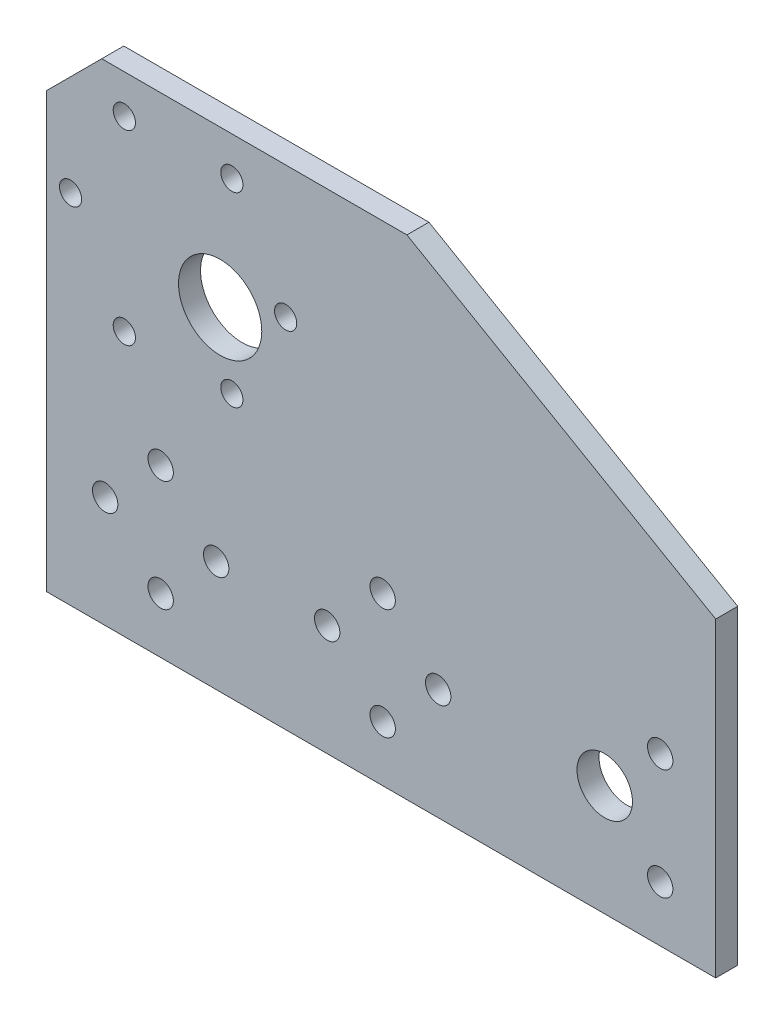
ISO-10303-21;
HEADER;
FILE_DESCRIPTION(('STEP AP214'),'2;1');
FILE_NAME('part.step','',(''),(''),'','','');
FILE_SCHEMA(('AUTOMOTIVE_DESIGN { 1 0 10303 214 1 1 1 1 }'));
ENDSEC;
DATA;
#1=APPLICATION_CONTEXT('core data for automotive mechanical design processes');
#2=APPLICATION_PROTOCOL_DEFINITION('international standard','automotive_design',2000,#1);
#3=PRODUCT_CONTEXT('',#1,'mechanical');
#4=PRODUCT('Part','Part','',(#3));
#5=PRODUCT_RELATED_PRODUCT_CATEGORY('part','',(#4));
#6=PRODUCT_DEFINITION_FORMATION('','',#4);
#7=PRODUCT_DEFINITION_CONTEXT('part definition',#1,'design');
#8=PRODUCT_DEFINITION('design','',#6,#7);
#9=PRODUCT_DEFINITION_SHAPE('','',#8);
#10=(LENGTH_UNIT() NAMED_UNIT(*) SI_UNIT(.MILLI.,.METRE.));
#11=(NAMED_UNIT(*) PLANE_ANGLE_UNIT() SI_UNIT($,.RADIAN.));
#12=(NAMED_UNIT(*) SI_UNIT($,.STERADIAN.) SOLID_ANGLE_UNIT());
#13=UNCERTAINTY_MEASURE_WITH_UNIT(LENGTH_MEASURE(1.E-05),#10,'distance_accuracy_value','');
#14=(GEOMETRIC_REPRESENTATION_CONTEXT(3) GLOBAL_UNCERTAINTY_ASSIGNED_CONTEXT((#13)) GLOBAL_UNIT_ASSIGNED_CONTEXT((#10,
#11,#12)) REPRESENTATION_CONTEXT('',''));
#15=CARTESIAN_POINT('',(0.,0.,0.));
#16=DIRECTION('',(0.,0.,1.));
#17=DIRECTION('',(1.,0.,0.));
#18=AXIS2_PLACEMENT_3D('',#15,#16,#17);
#19=CARTESIAN_POINT('',(16.,28.803791580562,-3.175));
#20=DIRECTION('',(1.,0.,0.));
#21=DIRECTION('',(0.,1.,0.));
#22=AXIS2_PLACEMENT_3D('',#19,#20,#21);
#23=PLANE('',#22);
#24=DIRECTION('',(0.,1.,0.));
#25=VECTOR('',#24,1.);
#26=CARTESIAN_POINT('',(16.,28.803791580562,0.));
#27=LINE('',#26,#25);
#28=CARTESIAN_POINT('',(16.,-16.,0.));
#29=VERTEX_POINT('',#28);
#30=CARTESIAN_POINT('',(16.,28.803791580562,0.));
#31=VERTEX_POINT('',#30);
#32=EDGE_CURVE('E117',#29,#31,#27,.T.);
#33=ORIENTED_EDGE('',*,*,#32,.F.);
#34=DIRECTION('',(0.,0.,1.));
#35=VECTOR('',#34,1.);
#36=CARTESIAN_POINT('',(16.,-16.,-3.175));
#37=LINE('',#36,#35);
#38=CARTESIAN_POINT('',(16.,-16.,-3.175));
#39=VERTEX_POINT('',#38);
#40=EDGE_CURVE('E11',#39,#29,#37,.T.);
#41=ORIENTED_EDGE('',*,*,#40,.F.);
#42=DIRECTION('',(0.,1.,0.));
#43=VECTOR('',#42,1.);
#44=CARTESIAN_POINT('',(16.,28.803791580562,-3.175));
#45=LINE('',#44,#43);
#46=CARTESIAN_POINT('',(16.,28.803791580562,-3.175));
#47=VERTEX_POINT('',#46);
#48=EDGE_CURVE('E132',#39,#47,#45,.T.);
#49=ORIENTED_EDGE('',*,*,#48,.T.);
#50=DIRECTION('',(0.,0.,1.));
#51=VECTOR('',#50,1.);
#52=CARTESIAN_POINT('',(16.,28.803791580562,-3.175));
#53=LINE('',#52,#51);
#54=EDGE_CURVE('E35',#47,#31,#53,.T.);
#55=ORIENTED_EDGE('',*,*,#54,.T.);
#56=EDGE_LOOP('',(#33,#41,#49,#55));
#57=FACE_BOUND('',#56,.T.);
#58=ADVANCED_FACE('F32',(#57),#23,.T.);
#59=CARTESIAN_POINT('',(16.,-16.,-3.175));
#60=DIRECTION('',(0.,-1.,0.));
#61=DIRECTION('',(1.,0.,0.));
#62=AXIS2_PLACEMENT_3D('',#59,#60,#61);
#63=PLANE('',#62);
#64=DIRECTION('',(1.,0.,0.));
#65=VECTOR('',#64,1.);
#66=CARTESIAN_POINT('',(16.,-16.,0.));
#67=LINE('',#66,#65);
#68=CARTESIAN_POINT('',(-80.4878036686956,-16.,0.));
#69=VERTEX_POINT('',#68);
#70=EDGE_CURVE('E130',#69,#29,#67,.T.);
#71=ORIENTED_EDGE('',*,*,#70,.F.);
#72=DIRECTION('',(0.,0.,1.));
#73=VECTOR('',#72,1.);
#74=CARTESIAN_POINT('',(-80.4878036686956,-16.,-3.175));
#75=LINE('',#74,#73);
#76=CARTESIAN_POINT('',(-80.4878036686956,-16.,-3.175));
#77=VERTEX_POINT('',#76);
#78=EDGE_CURVE('E41',#77,#69,#75,.T.);
#79=ORIENTED_EDGE('',*,*,#78,.F.);
#80=DIRECTION('',(1.,0.,0.));
#81=VECTOR('',#80,1.);
#82=CARTESIAN_POINT('',(16.,-16.,-3.175));
#83=LINE('',#82,#81);
#84=EDGE_CURVE('E107',#77,#39,#83,.T.);
#85=ORIENTED_EDGE('',*,*,#84,.T.);
#86=ORIENTED_EDGE('',*,*,#40,.T.);
#87=EDGE_LOOP('',(#71,#79,#85,#86));
#88=FACE_BOUND('',#87,.T.);
#89=ADVANCED_FACE('F140',(#88),#63,.T.);
#90=CARTESIAN_POINT('',(-80.4878036686956,-16.,-3.175));
#91=DIRECTION('',(-1.,0.,0.));
#92=DIRECTION('',(0.,0.,1.));
#93=AXIS2_PLACEMENT_3D('',#90,#91,#92);
#94=PLANE('',#93);
#95=DIRECTION('',(0.,-1.,0.));
#96=VECTOR('',#95,1.);
#97=CARTESIAN_POINT('',(-80.4878036686956,-16.,0.));
#98=LINE('',#97,#96);
#99=CARTESIAN_POINT('',(-80.4878036686956,46.5,0.));
#100=VERTEX_POINT('',#99);
#101=EDGE_CURVE('E94',#100,#69,#98,.T.);
#102=ORIENTED_EDGE('',*,*,#101,.F.);
#103=DIRECTION('',(0.,0.,1.));
#104=VECTOR('',#103,1.);
#105=CARTESIAN_POINT('',(-80.4878036686956,46.5,-3.175));
#106=LINE('',#105,#104);
#107=CARTESIAN_POINT('',(-80.4878036686956,46.5,-3.175));
#108=VERTEX_POINT('',#107);
#109=EDGE_CURVE('E89',#108,#100,#106,.T.);
#110=ORIENTED_EDGE('',*,*,#109,.F.);
#111=DIRECTION('',(0.,-1.,0.));
#112=VECTOR('',#111,1.);
#113=CARTESIAN_POINT('',(-80.4878036686956,-16.,-3.175));
#114=LINE('',#113,#112);
#115=EDGE_CURVE('E92',#108,#77,#114,.T.);
#116=ORIENTED_EDGE('',*,*,#115,.T.);
#117=ORIENTED_EDGE('',*,*,#78,.T.);
#118=EDGE_LOOP('',(#102,#110,#116,#117));
#119=FACE_BOUND('',#118,.T.);
#120=ADVANCED_FACE('F91',(#119),#94,.T.);
#121=CARTESIAN_POINT('',(-72.4878036686956,54.5000000000001,-3.175));
#122=DIRECTION('',(-0.707106781186548,0.707106781186548,0.));
#123=DIRECTION('',(-0.707106781186548,-0.707106781186548,0.));
#124=AXIS2_PLACEMENT_3D('',#121,#122,#123);
#125=PLANE('',#124);
#126=DIRECTION('',(-0.707106781186548,-0.707106781186548,0.));
#127=VECTOR('',#126,1.);
#128=CARTESIAN_POINT('',(-72.4878036686956,54.5000000000001,0.));
#129=LINE('',#128,#127);
#130=CARTESIAN_POINT('',(-72.4878036686956,54.5000000000001,0.));
#131=VERTEX_POINT('',#130);
#132=EDGE_CURVE('E127',#131,#100,#129,.T.);
#133=ORIENTED_EDGE('',*,*,#132,.F.);
#134=DIRECTION('',(0.,0.,1.));
#135=VECTOR('',#134,1.);
#136=CARTESIAN_POINT('',(-72.4878036686956,54.5000000000001,-3.175));
#137=LINE('',#136,#135);
#138=CARTESIAN_POINT('',(-72.4878036686956,54.5000000000001,-3.175));
#139=VERTEX_POINT('',#138);
#140=EDGE_CURVE('E99',#139,#131,#137,.T.);
#141=ORIENTED_EDGE('',*,*,#140,.F.);
#142=DIRECTION('',(-0.707106781186548,-0.707106781186548,0.));
#143=VECTOR('',#142,1.);
#144=CARTESIAN_POINT('',(-72.4878036686956,54.5000000000001,-3.175));
#145=LINE('',#144,#143);
#146=EDGE_CURVE('E105',#139,#108,#145,.T.);
#147=ORIENTED_EDGE('',*,*,#146,.T.);
#148=ORIENTED_EDGE('',*,*,#109,.T.);
#149=EDGE_LOOP('',(#133,#141,#147,#148));
#150=FACE_BOUND('',#149,.T.);
#151=ADVANCED_FACE('F109',(#150),#125,.T.);
#152=CARTESIAN_POINT('',(-28.5071385443465,54.5000000000002,-3.175));
#153=DIRECTION('',(0.,1.,0.));
#154=DIRECTION('',(-1.,0.,0.));
#155=AXIS2_PLACEMENT_3D('',#152,#153,#154);
#156=PLANE('',#155);
#157=DIRECTION('',(-1.,0.,0.));
#158=VECTOR('',#157,1.);
#159=CARTESIAN_POINT('',(-28.5071385443465,54.5000000000002,0.));
#160=LINE('',#159,#158);
#161=CARTESIAN_POINT('',(-28.5071385443465,54.5000000000002,0.));
#162=VERTEX_POINT('',#161);
#163=EDGE_CURVE('E124',#162,#131,#160,.T.);
#164=ORIENTED_EDGE('',*,*,#163,.F.);
#165=DIRECTION('',(0.,0.,1.));
#166=VECTOR('',#165,1.);
#167=CARTESIAN_POINT('',(-28.5071385443465,54.5000000000002,-3.175));
#168=LINE('',#167,#166);
#169=CARTESIAN_POINT('',(-28.5071385443465,54.5000000000002,-3.175));
#170=VERTEX_POINT('',#169);
#171=EDGE_CURVE('E135',#170,#162,#168,.T.);
#172=ORIENTED_EDGE('',*,*,#171,.F.);
#173=DIRECTION('',(-1.,0.,0.));
#174=VECTOR('',#173,1.);
#175=CARTESIAN_POINT('',(-28.5071385443465,54.5000000000002,-3.175));
#176=LINE('',#175,#174);
#177=EDGE_CURVE('E110',#170,#139,#176,.T.);
#178=ORIENTED_EDGE('',*,*,#177,.T.);
#179=ORIENTED_EDGE('',*,*,#140,.T.);
#180=EDGE_LOOP('',(#164,#172,#178,#179));
#181=FACE_BOUND('',#180,.T.);
#182=ADVANCED_FACE('F153',(#181),#156,.T.);
#183=CARTESIAN_POINT('',(16.,28.803791580562,-3.175));
#184=DIRECTION('',(0.499999999999999,0.866025403784441,0.));
#185=DIRECTION('',(-0.866025403784441,0.499999999999998,0.));
#186=AXIS2_PLACEMENT_3D('',#183,#184,#185);
#187=PLANE('',#186);
#188=DIRECTION('',(-0.86602540378444,0.499999999999998,0.));
#189=VECTOR('',#188,1.);
#190=CARTESIAN_POINT('',(16.,28.803791580562,0.));
#191=LINE('',#190,#189);
#192=EDGE_CURVE('E120',#31,#162,#191,.T.);
#193=ORIENTED_EDGE('',*,*,#192,.F.);
#194=ORIENTED_EDGE('',*,*,#54,.F.);
#195=DIRECTION('',(-0.86602540378444,0.499999999999998,0.));
#196=VECTOR('',#195,1.);
#197=CARTESIAN_POINT('',(16.,28.803791580562,-3.175));
#198=LINE('',#197,#196);
#199=EDGE_CURVE('E112',#47,#170,#198,.T.);
#200=ORIENTED_EDGE('',*,*,#199,.T.);
#201=ORIENTED_EDGE('',*,*,#171,.T.);
#202=EDGE_LOOP('',(#193,#194,#200,#201));
#203=FACE_BOUND('',#202,.T.);
#204=ADVANCED_FACE('F137',(#203),#187,.T.);
#205=CARTESIAN_POINT('',(0.,0.,-3.175));
#206=DIRECTION('',(0.,0.,-1.));
#207=DIRECTION('',(-1.,0.,0.));
#208=AXIS2_PLACEMENT_3D('',#205,#206,#207);
#209=PLANE('',#208);
#210=CARTESIAN_POINT('',(-32.,7.99999999999999,-3.175));
#211=DIRECTION('',(0.,0.,1.));
#212=DIRECTION('',(1.,0.,0.));
#213=AXIS2_PLACEMENT_3D('',#210,#211,#212);
#214=CIRCLE('',#213,1.82879999999999);
#215=CARTESIAN_POINT('',(-30.1712,7.99999999999999,-3.175));
#216=VERTEX_POINT('',#215);
#217=EDGE_CURVE('E243',#216,#216,#214,.T.);
#218=ORIENTED_EDGE('',*,*,#217,.T.);
#219=EDGE_LOOP('',(#218));
#220=FACE_BOUND('',#219,.T.);
#221=CARTESIAN_POINT('',(-24.,0.,-3.175));
#222=DIRECTION('',(0.,0.,1.));
#223=DIRECTION('',(1.,0.,0.));
#224=AXIS2_PLACEMENT_3D('',#221,#222,#223);
#225=CIRCLE('',#224,1.82879999999999);
#226=CARTESIAN_POINT('',(-22.1712,0.,-3.175));
#227=VERTEX_POINT('',#226);
#228=EDGE_CURVE('E253',#227,#227,#225,.T.);
#229=ORIENTED_EDGE('',*,*,#228,.T.);
#230=EDGE_LOOP('',(#229));
#231=FACE_BOUND('',#230,.T.);
#232=CARTESIAN_POINT('',(-64.0000000000001,7.99999999999998,-3.175));
#233=DIRECTION('',(0.,0.,1.));
#234=DIRECTION('',(1.,0.,0.));
#235=AXIS2_PLACEMENT_3D('',#232,#233,#234);
#236=CIRCLE('',#235,1.82879999999999);
#237=CARTESIAN_POINT('',(-62.1712000000001,7.99999999999998,-3.175));
#238=VERTEX_POINT('',#237);
#239=EDGE_CURVE('E259',#238,#238,#236,.T.);
#240=ORIENTED_EDGE('',*,*,#239,.T.);
#241=EDGE_LOOP('',(#240));
#242=FACE_BOUND('',#241,.T.);
#243=CARTESIAN_POINT('',(-56.0000000000001,0.,-3.175));
#244=DIRECTION('',(0.,0.,1.));
#245=DIRECTION('',(1.,0.,0.));
#246=AXIS2_PLACEMENT_3D('',#243,#244,#245);
#247=CIRCLE('',#246,1.82879999999999);
#248=CARTESIAN_POINT('',(-54.1712000000001,0.,-3.175));
#249=VERTEX_POINT('',#248);
#250=EDGE_CURVE('E265',#249,#249,#247,.T.);
#251=ORIENTED_EDGE('',*,*,#250,.T.);
#252=EDGE_LOOP('',(#251));
#253=FACE_BOUND('',#252,.T.);
#254=CARTESIAN_POINT('',(-40.,0.,-3.175));
#255=DIRECTION('',(0.,0.,1.));
#256=DIRECTION('',(1.,0.,0.));
#257=AXIS2_PLACEMENT_3D('',#254,#255,#256);
#258=CIRCLE('',#257,1.82879999999999);
#259=CARTESIAN_POINT('',(-38.1712,0.,-3.175));
#260=VERTEX_POINT('',#259);
#261=EDGE_CURVE('E271',#260,#260,#258,.T.);
#262=ORIENTED_EDGE('',*,*,#261,.T.);
#263=EDGE_LOOP('',(#262));
#264=FACE_BOUND('',#263,.T.);
#265=CARTESIAN_POINT('',(8.,8.,-3.175));
#266=DIRECTION('',(0.,0.,1.));
#267=DIRECTION('',(1.,0.,0.));
#268=AXIS2_PLACEMENT_3D('',#265,#266,#267);
#269=CIRCLE('',#268,1.82879999999999);
#270=CARTESIAN_POINT('',(9.82879999999999,8.,-3.175));
#271=VERTEX_POINT('',#270);
#272=EDGE_CURVE('E277',#271,#271,#269,.T.);
#273=ORIENTED_EDGE('',*,*,#272,.T.);
#274=EDGE_LOOP('',(#273));
#275=FACE_BOUND('',#274,.T.);
#276=CARTESIAN_POINT('',(8.,-7.99999999999999,-3.175));
#277=DIRECTION('',(0.,0.,1.));
#278=DIRECTION('',(1.,0.,0.));
#279=AXIS2_PLACEMENT_3D('',#276,#277,#278);
#280=CIRCLE('',#279,1.82879999999999);
#281=CARTESIAN_POINT('',(9.82879999999999,-7.99999999999999,-3.175));
#282=VERTEX_POINT('',#281);
#283=EDGE_CURVE('E283',#282,#282,#280,.T.);
#284=ORIENTED_EDGE('',*,*,#283,.T.);
#285=EDGE_LOOP('',(#284));
#286=FACE_BOUND('',#285,.T.);
#287=CARTESIAN_POINT('',(-32.,-8.00000000000001,-3.175));
#288=DIRECTION('',(0.,0.,1.));
#289=DIRECTION('',(1.,0.,0.));
#290=AXIS2_PLACEMENT_3D('',#287,#288,#289);
#291=CIRCLE('',#290,1.8288);
#292=CARTESIAN_POINT('',(-30.1712,-8.00000000000001,-3.175));
#293=VERTEX_POINT('',#292);
#294=EDGE_CURVE('E289',#293,#293,#291,.T.);
#295=ORIENTED_EDGE('',*,*,#294,.T.);
#296=EDGE_LOOP('',(#295));
#297=FACE_BOUND('',#296,.T.);
#298=CARTESIAN_POINT('',(-64.0000000000001,-8.00000000000002,-3.175));
#299=DIRECTION('',(0.,0.,1.));
#300=DIRECTION('',(1.,0.,0.));
#301=AXIS2_PLACEMENT_3D('',#298,#299,#300);
#302=CIRCLE('',#301,1.8288);
#303=CARTESIAN_POINT('',(-62.1712000000001,-8.00000000000002,-3.175));
#304=VERTEX_POINT('',#303);
#305=EDGE_CURVE('E295',#304,#304,#302,.T.);
#306=ORIENTED_EDGE('',*,*,#305,.T.);
#307=EDGE_LOOP('',(#306));
#308=FACE_BOUND('',#307,.T.);
#309=CARTESIAN_POINT('',(-72.0000000000001,0.,-3.175));
#310=DIRECTION('',(0.,0.,1.));
#311=DIRECTION('',(1.,0.,0.));
#312=AXIS2_PLACEMENT_3D('',#309,#310,#311);
#313=CIRCLE('',#312,1.82880000000001);
#314=CARTESIAN_POINT('',(-70.1712000000001,0.,-3.175));
#315=VERTEX_POINT('',#314);
#316=EDGE_CURVE('E301',#315,#315,#313,.T.);
#317=ORIENTED_EDGE('',*,*,#316,.T.);
#318=EDGE_LOOP('',(#317));
#319=FACE_BOUND('',#318,.T.);
#320=CARTESIAN_POINT('',(-55.4256258422042,31.9999999999999,-3.175));
#321=DIRECTION('',(0.,0.,1.));
#322=DIRECTION('',(1.,0.,0.));
#323=AXIS2_PLACEMENT_3D('',#320,#321,#322);
#324=CIRCLE('',#323,6.);
#325=CARTESIAN_POINT('',(-49.4256258422042,31.9999999999999,-3.175));
#326=VERTEX_POINT('',#325);
#327=EDGE_CURVE('E307',#326,#326,#324,.T.);
#328=ORIENTED_EDGE('',*,*,#327,.T.);
#329=EDGE_LOOP('',(#328));
#330=FACE_BOUND('',#329,.T.);
#331=CARTESIAN_POINT('',(-69.2378036686955,48.9233937586586,-3.175));
#332=DIRECTION('',(0.,0.,1.));
#333=DIRECTION('',(1.,0.,0.));
#334=AXIS2_PLACEMENT_3D('',#331,#332,#333);
#335=CIRCLE('',#334,1.6);
#336=CARTESIAN_POINT('',(-67.6378036686955,48.9233937586586,-3.175));
#337=VERTEX_POINT('',#336);
#338=EDGE_CURVE('E313',#337,#337,#335,.T.);
#339=ORIENTED_EDGE('',*,*,#338,.T.);
#340=EDGE_LOOP('',(#339));
#341=FACE_BOUND('',#340,.T.);
#342=CARTESIAN_POINT('',(-53.7378036686953,48.9233937586587,-3.175));
#343=DIRECTION('',(0.,0.,1.));
#344=DIRECTION('',(1.,0.,0.));
#345=AXIS2_PLACEMENT_3D('',#342,#343,#344);
#346=CIRCLE('',#345,1.6);
#347=CARTESIAN_POINT('',(-52.1378036686953,48.9233937586587,-3.175));
#348=VERTEX_POINT('',#347);
#349=EDGE_CURVE('E319',#348,#348,#346,.T.);
#350=ORIENTED_EDGE('',*,*,#349,.T.);
#351=EDGE_LOOP('',(#350));
#352=FACE_BOUND('',#351,.T.);
#353=CARTESIAN_POINT('',(-45.9878036686953,35.5,-3.175));
#354=DIRECTION('',(0.,0.,1.));
#355=DIRECTION('',(1.,0.,0.));
#356=AXIS2_PLACEMENT_3D('',#353,#354,#355);
#357=CIRCLE('',#356,1.6);
#358=CARTESIAN_POINT('',(-44.3878036686953,35.5,-3.175));
#359=VERTEX_POINT('',#358);
#360=EDGE_CURVE('E325',#359,#359,#357,.T.);
#361=ORIENTED_EDGE('',*,*,#360,.T.);
#362=EDGE_LOOP('',(#361));
#363=FACE_BOUND('',#362,.T.);
#364=CARTESIAN_POINT('',(-53.7378036686952,22.0766062413411,-3.175));
#365=DIRECTION('',(0.,0.,1.));
#366=DIRECTION('',(1.,0.,0.));
#367=AXIS2_PLACEMENT_3D('',#364,#365,#366);
#368=CIRCLE('',#367,1.6);
#369=CARTESIAN_POINT('',(-52.1378036686952,22.0766062413411,-3.175));
#370=VERTEX_POINT('',#369);
#371=EDGE_CURVE('E331',#370,#370,#368,.T.);
#372=ORIENTED_EDGE('',*,*,#371,.T.);
#373=EDGE_LOOP('',(#372));
#374=FACE_BOUND('',#373,.T.);
#375=CARTESIAN_POINT('',(-69.2378036686952,22.076606241341,-3.175));
#376=DIRECTION('',(0.,0.,1.));
#377=DIRECTION('',(1.,0.,0.));
#378=AXIS2_PLACEMENT_3D('',#375,#376,#377);
#379=CIRCLE('',#378,1.6);
#380=CARTESIAN_POINT('',(-67.6378036686952,22.076606241341,-3.175));
#381=VERTEX_POINT('',#380);
#382=EDGE_CURVE('E337',#381,#381,#379,.T.);
#383=ORIENTED_EDGE('',*,*,#382,.T.);
#384=EDGE_LOOP('',(#383));
#385=FACE_BOUND('',#384,.T.);
#386=CARTESIAN_POINT('',(-76.9878036686953,35.4999999999997,-3.175));
#387=DIRECTION('',(0.,0.,1.));
#388=DIRECTION('',(1.,0.,0.));
#389=AXIS2_PLACEMENT_3D('',#386,#387,#388);
#390=CIRCLE('',#389,1.6);
#391=CARTESIAN_POINT('',(-75.3878036686953,35.4999999999997,-3.175));
#392=VERTEX_POINT('',#391);
#393=EDGE_CURVE('E343',#392,#392,#390,.T.);
#394=ORIENTED_EDGE('',*,*,#393,.T.);
#395=EDGE_LOOP('',(#394));
#396=FACE_BOUND('',#395,.T.);
#397=CARTESIAN_POINT('',(0.,0.,-3.175));
#398=DIRECTION('',(0.,0.,1.));
#399=DIRECTION('',(1.,0.,0.));
#400=AXIS2_PLACEMENT_3D('',#397,#398,#399);
#401=CIRCLE('',#400,4.);
#402=CARTESIAN_POINT('',(4.,0.,-3.175));
#403=VERTEX_POINT('',#402);
#404=EDGE_CURVE('E121',#403,#403,#401,.T.);
#405=ORIENTED_EDGE('',*,*,#404,.T.);
#406=EDGE_LOOP('',(#405));
#407=FACE_BOUND('',#406,.T.);
#408=ORIENTED_EDGE('',*,*,#48,.F.);
#409=ORIENTED_EDGE('',*,*,#84,.F.);
#410=ORIENTED_EDGE('',*,*,#115,.F.);
#411=ORIENTED_EDGE('',*,*,#146,.F.);
#412=ORIENTED_EDGE('',*,*,#177,.F.);
#413=ORIENTED_EDGE('',*,*,#199,.F.);
#414=EDGE_LOOP('',(#408,#409,#410,#411,#412,#413));
#415=FACE_BOUND('',#414,.T.);
#416=ADVANCED_FACE('F103',(#220,#231,#242,#253,#264,#275,#286,#297,#308,#319,#330,#341,#352,
#363,#374,#385,#396,#407,#415),#209,.T.);
#417=CARTESIAN_POINT('',(0.,0.,0.));
#418=DIRECTION('',(0.,0.,-1.));
#419=DIRECTION('',(-1.,0.,0.));
#420=AXIS2_PLACEMENT_3D('',#417,#418,#419);
#421=PLANE('',#420);
#422=CARTESIAN_POINT('',(-32.,7.99999999999999,0.));
#423=DIRECTION('',(0.,0.,1.));
#424=DIRECTION('',(1.,0.,0.));
#425=AXIS2_PLACEMENT_3D('',#422,#423,#424);
#426=CIRCLE('',#425,1.82879999999999);
#427=CARTESIAN_POINT('',(-30.1712,7.99999999999999,0.));
#428=VERTEX_POINT('',#427);
#429=EDGE_CURVE('E246',#428,#428,#426,.T.);
#430=ORIENTED_EDGE('',*,*,#429,.F.);
#431=EDGE_LOOP('',(#430));
#432=FACE_BOUND('',#431,.T.);
#433=CARTESIAN_POINT('',(-24.,0.,0.));
#434=DIRECTION('',(0.,0.,1.));
#435=DIRECTION('',(1.,0.,0.));
#436=AXIS2_PLACEMENT_3D('',#433,#434,#435);
#437=CIRCLE('',#436,1.82879999999999);
#438=CARTESIAN_POINT('',(-22.1712,0.,0.));
#439=VERTEX_POINT('',#438);
#440=EDGE_CURVE('E248',#439,#439,#437,.T.);
#441=ORIENTED_EDGE('',*,*,#440,.F.);
#442=EDGE_LOOP('',(#441));
#443=FACE_BOUND('',#442,.T.);
#444=CARTESIAN_POINT('',(-64.0000000000001,7.99999999999998,0.));
#445=DIRECTION('',(0.,0.,1.));
#446=DIRECTION('',(1.,0.,0.));
#447=AXIS2_PLACEMENT_3D('',#444,#445,#446);
#448=CIRCLE('',#447,1.82879999999999);
#449=CARTESIAN_POINT('',(-62.1712000000001,7.99999999999998,0.));
#450=VERTEX_POINT('',#449);
#451=EDGE_CURVE('E256',#450,#450,#448,.T.);
#452=ORIENTED_EDGE('',*,*,#451,.F.);
#453=EDGE_LOOP('',(#452));
#454=FACE_BOUND('',#453,.T.);
#455=CARTESIAN_POINT('',(-56.0000000000001,0.,0.));
#456=DIRECTION('',(0.,0.,1.));
#457=DIRECTION('',(1.,0.,0.));
#458=AXIS2_PLACEMENT_3D('',#455,#456,#457);
#459=CIRCLE('',#458,1.82879999999999);
#460=CARTESIAN_POINT('',(-54.1712000000001,0.,0.));
#461=VERTEX_POINT('',#460);
#462=EDGE_CURVE('E262',#461,#461,#459,.T.);
#463=ORIENTED_EDGE('',*,*,#462,.F.);
#464=EDGE_LOOP('',(#463));
#465=FACE_BOUND('',#464,.T.);
#466=CARTESIAN_POINT('',(-40.,0.,0.));
#467=DIRECTION('',(0.,0.,1.));
#468=DIRECTION('',(1.,0.,0.));
#469=AXIS2_PLACEMENT_3D('',#466,#467,#468);
#470=CIRCLE('',#469,1.82879999999999);
#471=CARTESIAN_POINT('',(-38.1712,0.,0.));
#472=VERTEX_POINT('',#471);
#473=EDGE_CURVE('E268',#472,#472,#470,.T.);
#474=ORIENTED_EDGE('',*,*,#473,.F.);
#475=EDGE_LOOP('',(#474));
#476=FACE_BOUND('',#475,.T.);
#477=CARTESIAN_POINT('',(8.,8.,0.));
#478=DIRECTION('',(0.,0.,1.));
#479=DIRECTION('',(1.,0.,0.));
#480=AXIS2_PLACEMENT_3D('',#477,#478,#479);
#481=CIRCLE('',#480,1.82879999999999);
#482=CARTESIAN_POINT('',(9.82879999999999,8.,0.));
#483=VERTEX_POINT('',#482);
#484=EDGE_CURVE('E274',#483,#483,#481,.T.);
#485=ORIENTED_EDGE('',*,*,#484,.F.);
#486=EDGE_LOOP('',(#485));
#487=FACE_BOUND('',#486,.T.);
#488=CARTESIAN_POINT('',(8.,-7.99999999999999,0.));
#489=DIRECTION('',(0.,0.,1.));
#490=DIRECTION('',(1.,0.,0.));
#491=AXIS2_PLACEMENT_3D('',#488,#489,#490);
#492=CIRCLE('',#491,1.82879999999999);
#493=CARTESIAN_POINT('',(9.82879999999999,-7.99999999999999,0.));
#494=VERTEX_POINT('',#493);
#495=EDGE_CURVE('E280',#494,#494,#492,.T.);
#496=ORIENTED_EDGE('',*,*,#495,.F.);
#497=EDGE_LOOP('',(#496));
#498=FACE_BOUND('',#497,.T.);
#499=CARTESIAN_POINT('',(-32.,-8.00000000000001,0.));
#500=DIRECTION('',(0.,0.,1.));
#501=DIRECTION('',(1.,0.,0.));
#502=AXIS2_PLACEMENT_3D('',#499,#500,#501);
#503=CIRCLE('',#502,1.8288);
#504=CARTESIAN_POINT('',(-30.1712,-8.00000000000001,0.));
#505=VERTEX_POINT('',#504);
#506=EDGE_CURVE('E286',#505,#505,#503,.T.);
#507=ORIENTED_EDGE('',*,*,#506,.F.);
#508=EDGE_LOOP('',(#507));
#509=FACE_BOUND('',#508,.T.);
#510=CARTESIAN_POINT('',(-64.0000000000001,-8.00000000000002,0.));
#511=DIRECTION('',(0.,0.,1.));
#512=DIRECTION('',(1.,0.,0.));
#513=AXIS2_PLACEMENT_3D('',#510,#511,#512);
#514=CIRCLE('',#513,1.8288);
#515=CARTESIAN_POINT('',(-62.1712000000001,-8.00000000000002,0.));
#516=VERTEX_POINT('',#515);
#517=EDGE_CURVE('E292',#516,#516,#514,.T.);
#518=ORIENTED_EDGE('',*,*,#517,.F.);
#519=EDGE_LOOP('',(#518));
#520=FACE_BOUND('',#519,.T.);
#521=CARTESIAN_POINT('',(-72.0000000000001,0.,0.));
#522=DIRECTION('',(0.,0.,1.));
#523=DIRECTION('',(1.,0.,0.));
#524=AXIS2_PLACEMENT_3D('',#521,#522,#523);
#525=CIRCLE('',#524,1.82880000000001);
#526=CARTESIAN_POINT('',(-70.1712000000001,0.,0.));
#527=VERTEX_POINT('',#526);
#528=EDGE_CURVE('E298',#527,#527,#525,.T.);
#529=ORIENTED_EDGE('',*,*,#528,.F.);
#530=EDGE_LOOP('',(#529));
#531=FACE_BOUND('',#530,.T.);
#532=CARTESIAN_POINT('',(-55.4256258422042,31.9999999999999,0.));
#533=DIRECTION('',(0.,0.,1.));
#534=DIRECTION('',(1.,0.,0.));
#535=AXIS2_PLACEMENT_3D('',#532,#533,#534);
#536=CIRCLE('',#535,6.);
#537=CARTESIAN_POINT('',(-49.4256258422042,31.9999999999999,0.));
#538=VERTEX_POINT('',#537);
#539=EDGE_CURVE('E304',#538,#538,#536,.T.);
#540=ORIENTED_EDGE('',*,*,#539,.F.);
#541=EDGE_LOOP('',(#540));
#542=FACE_BOUND('',#541,.T.);
#543=CARTESIAN_POINT('',(-69.2378036686955,48.9233937586586,0.));
#544=DIRECTION('',(0.,0.,1.));
#545=DIRECTION('',(1.,0.,0.));
#546=AXIS2_PLACEMENT_3D('',#543,#544,#545);
#547=CIRCLE('',#546,1.6);
#548=CARTESIAN_POINT('',(-67.6378036686955,48.9233937586586,0.));
#549=VERTEX_POINT('',#548);
#550=EDGE_CURVE('E310',#549,#549,#547,.T.);
#551=ORIENTED_EDGE('',*,*,#550,.F.);
#552=EDGE_LOOP('',(#551));
#553=FACE_BOUND('',#552,.T.);
#554=CARTESIAN_POINT('',(-53.7378036686953,48.9233937586587,0.));
#555=DIRECTION('',(0.,0.,1.));
#556=DIRECTION('',(1.,0.,0.));
#557=AXIS2_PLACEMENT_3D('',#554,#555,#556);
#558=CIRCLE('',#557,1.6);
#559=CARTESIAN_POINT('',(-52.1378036686953,48.9233937586587,0.));
#560=VERTEX_POINT('',#559);
#561=EDGE_CURVE('E316',#560,#560,#558,.T.);
#562=ORIENTED_EDGE('',*,*,#561,.F.);
#563=EDGE_LOOP('',(#562));
#564=FACE_BOUND('',#563,.T.);
#565=CARTESIAN_POINT('',(-45.9878036686953,35.5,0.));
#566=DIRECTION('',(0.,0.,1.));
#567=DIRECTION('',(1.,0.,0.));
#568=AXIS2_PLACEMENT_3D('',#565,#566,#567);
#569=CIRCLE('',#568,1.6);
#570=CARTESIAN_POINT('',(-44.3878036686953,35.5,0.));
#571=VERTEX_POINT('',#570);
#572=EDGE_CURVE('E322',#571,#571,#569,.T.);
#573=ORIENTED_EDGE('',*,*,#572,.F.);
#574=EDGE_LOOP('',(#573));
#575=FACE_BOUND('',#574,.T.);
#576=CARTESIAN_POINT('',(-53.7378036686952,22.0766062413411,0.));
#577=DIRECTION('',(0.,0.,1.));
#578=DIRECTION('',(1.,0.,0.));
#579=AXIS2_PLACEMENT_3D('',#576,#577,#578);
#580=CIRCLE('',#579,1.6);
#581=CARTESIAN_POINT('',(-52.1378036686952,22.0766062413411,0.));
#582=VERTEX_POINT('',#581);
#583=EDGE_CURVE('E328',#582,#582,#580,.T.);
#584=ORIENTED_EDGE('',*,*,#583,.F.);
#585=EDGE_LOOP('',(#584));
#586=FACE_BOUND('',#585,.T.);
#587=CARTESIAN_POINT('',(-69.2378036686952,22.076606241341,0.));
#588=DIRECTION('',(0.,0.,1.));
#589=DIRECTION('',(1.,0.,0.));
#590=AXIS2_PLACEMENT_3D('',#587,#588,#589);
#591=CIRCLE('',#590,1.6);
#592=CARTESIAN_POINT('',(-67.6378036686952,22.076606241341,0.));
#593=VERTEX_POINT('',#592);
#594=EDGE_CURVE('E334',#593,#593,#591,.T.);
#595=ORIENTED_EDGE('',*,*,#594,.F.);
#596=EDGE_LOOP('',(#595));
#597=FACE_BOUND('',#596,.T.);
#598=CARTESIAN_POINT('',(-76.9878036686953,35.4999999999997,0.));
#599=DIRECTION('',(0.,0.,1.));
#600=DIRECTION('',(1.,0.,0.));
#601=AXIS2_PLACEMENT_3D('',#598,#599,#600);
#602=CIRCLE('',#601,1.6);
#603=CARTESIAN_POINT('',(-75.3878036686953,35.4999999999997,0.));
#604=VERTEX_POINT('',#603);
#605=EDGE_CURVE('E340',#604,#604,#602,.T.);
#606=ORIENTED_EDGE('',*,*,#605,.F.);
#607=EDGE_LOOP('',(#606));
#608=FACE_BOUND('',#607,.T.);
#609=CARTESIAN_POINT('',(0.,0.,0.));
#610=DIRECTION('',(0.,0.,1.));
#611=DIRECTION('',(1.,0.,0.));
#612=AXIS2_PLACEMENT_3D('',#609,#610,#611);
#613=CIRCLE('',#612,4.);
#614=CARTESIAN_POINT('',(4.,0.,0.));
#615=VERTEX_POINT('',#614);
#616=EDGE_CURVE('E346',#615,#615,#613,.T.);
#617=ORIENTED_EDGE('',*,*,#616,.F.);
#618=EDGE_LOOP('',(#617));
#619=FACE_BOUND('',#618,.T.);
#620=ORIENTED_EDGE('',*,*,#32,.T.);
#621=ORIENTED_EDGE('',*,*,#192,.T.);
#622=ORIENTED_EDGE('',*,*,#163,.T.);
#623=ORIENTED_EDGE('',*,*,#132,.T.);
#624=ORIENTED_EDGE('',*,*,#101,.T.);
#625=ORIENTED_EDGE('',*,*,#70,.T.);
#626=EDGE_LOOP('',(#620,#621,#622,#623,#624,#625));
#627=FACE_BOUND('',#626,.T.);
#628=ADVANCED_FACE('F139',(#432,#443,#454,#465,#476,#487,#498,#509,#520,#531,#542,#553,#564,
#575,#586,#597,#608,#619,#627),#421,.F.);
#629=CARTESIAN_POINT('',(0.,0.,-3.175));
#630=DIRECTION('',(0.,0.,1.));
#631=DIRECTION('',(1.,0.,0.));
#632=AXIS2_PLACEMENT_3D('',#629,#630,#631);
#633=CYLINDRICAL_SURFACE('',#632,4.);
#634=ORIENTED_EDGE('',*,*,#404,.F.);
#635=EDGE_LOOP('',(#634));
#636=FACE_BOUND('',#635,.T.);
#637=ORIENTED_EDGE('',*,*,#616,.T.);
#638=EDGE_LOOP('',(#637));
#639=FACE_BOUND('',#638,.T.);
#640=ADVANCED_FACE('F164',(#636,#639),#633,.F.);
#641=CARTESIAN_POINT('',(-76.9878036686953,35.4999999999997,0.));
#642=DIRECTION('',(0.,0.,1.));
#643=DIRECTION('',(1.,0.,0.));
#644=AXIS2_PLACEMENT_3D('',#641,#642,#643);
#645=CYLINDRICAL_SURFACE('',#644,1.6);
#646=ORIENTED_EDGE('',*,*,#393,.F.);
#647=EDGE_LOOP('',(#646));
#648=FACE_BOUND('',#647,.T.);
#649=ORIENTED_EDGE('',*,*,#605,.T.);
#650=EDGE_LOOP('',(#649));
#651=FACE_BOUND('',#650,.T.);
#652=ADVANCED_FACE('F171',(#648,#651),#645,.F.);
#653=CARTESIAN_POINT('',(-69.2378036686952,22.076606241341,0.));
#654=DIRECTION('',(0.,0.,1.));
#655=DIRECTION('',(1.,0.,0.));
#656=AXIS2_PLACEMENT_3D('',#653,#654,#655);
#657=CYLINDRICAL_SURFACE('',#656,1.6);
#658=ORIENTED_EDGE('',*,*,#382,.F.);
#659=EDGE_LOOP('',(#658));
#660=FACE_BOUND('',#659,.T.);
#661=ORIENTED_EDGE('',*,*,#594,.T.);
#662=EDGE_LOOP('',(#661));
#663=FACE_BOUND('',#662,.T.);
#664=ADVANCED_FACE('F175',(#660,#663),#657,.F.);
#665=CARTESIAN_POINT('',(-53.7378036686952,22.0766062413411,0.));
#666=DIRECTION('',(0.,0.,1.));
#667=DIRECTION('',(1.,0.,0.));
#668=AXIS2_PLACEMENT_3D('',#665,#666,#667);
#669=CYLINDRICAL_SURFACE('',#668,1.6);
#670=ORIENTED_EDGE('',*,*,#371,.F.);
#671=EDGE_LOOP('',(#670));
#672=FACE_BOUND('',#671,.T.);
#673=ORIENTED_EDGE('',*,*,#583,.T.);
#674=EDGE_LOOP('',(#673));
#675=FACE_BOUND('',#674,.T.);
#676=ADVANCED_FACE('F179',(#672,#675),#669,.F.);
#677=CARTESIAN_POINT('',(-45.9878036686953,35.5,0.));
#678=DIRECTION('',(0.,0.,1.));
#679=DIRECTION('',(1.,0.,0.));
#680=AXIS2_PLACEMENT_3D('',#677,#678,#679);
#681=CYLINDRICAL_SURFACE('',#680,1.6);
#682=ORIENTED_EDGE('',*,*,#360,.F.);
#683=EDGE_LOOP('',(#682));
#684=FACE_BOUND('',#683,.T.);
#685=ORIENTED_EDGE('',*,*,#572,.T.);
#686=EDGE_LOOP('',(#685));
#687=FACE_BOUND('',#686,.T.);
#688=ADVANCED_FACE('F183',(#684,#687),#681,.F.);
#689=CARTESIAN_POINT('',(-53.7378036686953,48.9233937586587,0.));
#690=DIRECTION('',(0.,0.,1.));
#691=DIRECTION('',(1.,0.,0.));
#692=AXIS2_PLACEMENT_3D('',#689,#690,#691);
#693=CYLINDRICAL_SURFACE('',#692,1.6);
#694=ORIENTED_EDGE('',*,*,#349,.F.);
#695=EDGE_LOOP('',(#694));
#696=FACE_BOUND('',#695,.T.);
#697=ORIENTED_EDGE('',*,*,#561,.T.);
#698=EDGE_LOOP('',(#697));
#699=FACE_BOUND('',#698,.T.);
#700=ADVANCED_FACE('F187',(#696,#699),#693,.F.);
#701=CARTESIAN_POINT('',(-69.2378036686955,48.9233937586586,0.));
#702=DIRECTION('',(0.,0.,1.));
#703=DIRECTION('',(1.,0.,0.));
#704=AXIS2_PLACEMENT_3D('',#701,#702,#703);
#705=CYLINDRICAL_SURFACE('',#704,1.6);
#706=ORIENTED_EDGE('',*,*,#338,.F.);
#707=EDGE_LOOP('',(#706));
#708=FACE_BOUND('',#707,.T.);
#709=ORIENTED_EDGE('',*,*,#550,.T.);
#710=EDGE_LOOP('',(#709));
#711=FACE_BOUND('',#710,.T.);
#712=ADVANCED_FACE('F191',(#708,#711),#705,.F.);
#713=CARTESIAN_POINT('',(-55.4256258422042,31.9999999999999,0.));
#714=DIRECTION('',(0.,0.,1.));
#715=DIRECTION('',(1.,0.,0.));
#716=AXIS2_PLACEMENT_3D('',#713,#714,#715);
#717=CYLINDRICAL_SURFACE('',#716,6.);
#718=ORIENTED_EDGE('',*,*,#327,.F.);
#719=EDGE_LOOP('',(#718));
#720=FACE_BOUND('',#719,.T.);
#721=ORIENTED_EDGE('',*,*,#539,.T.);
#722=EDGE_LOOP('',(#721));
#723=FACE_BOUND('',#722,.T.);
#724=ADVANCED_FACE('F195',(#720,#723),#717,.F.);
#725=CARTESIAN_POINT('',(-72.0000000000001,0.,0.));
#726=DIRECTION('',(0.,0.,1.));
#727=DIRECTION('',(1.,0.,0.));
#728=AXIS2_PLACEMENT_3D('',#725,#726,#727);
#729=CYLINDRICAL_SURFACE('',#728,1.82880000000001);
#730=ORIENTED_EDGE('',*,*,#316,.F.);
#731=EDGE_LOOP('',(#730));
#732=FACE_BOUND('',#731,.T.);
#733=ORIENTED_EDGE('',*,*,#528,.T.);
#734=EDGE_LOOP('',(#733));
#735=FACE_BOUND('',#734,.T.);
#736=ADVANCED_FACE('F199',(#732,#735),#729,.F.);
#737=CARTESIAN_POINT('',(-64.0000000000001,-8.00000000000002,0.));
#738=DIRECTION('',(0.,0.,1.));
#739=DIRECTION('',(1.,0.,0.));
#740=AXIS2_PLACEMENT_3D('',#737,#738,#739);
#741=CYLINDRICAL_SURFACE('',#740,1.8288);
#742=ORIENTED_EDGE('',*,*,#305,.F.);
#743=EDGE_LOOP('',(#742));
#744=FACE_BOUND('',#743,.T.);
#745=ORIENTED_EDGE('',*,*,#517,.T.);
#746=EDGE_LOOP('',(#745));
#747=FACE_BOUND('',#746,.T.);
#748=ADVANCED_FACE('F203',(#744,#747),#741,.F.);
#749=CARTESIAN_POINT('',(-32.,-8.00000000000001,0.));
#750=DIRECTION('',(0.,0.,1.));
#751=DIRECTION('',(1.,0.,0.));
#752=AXIS2_PLACEMENT_3D('',#749,#750,#751);
#753=CYLINDRICAL_SURFACE('',#752,1.8288);
#754=ORIENTED_EDGE('',*,*,#294,.F.);
#755=EDGE_LOOP('',(#754));
#756=FACE_BOUND('',#755,.T.);
#757=ORIENTED_EDGE('',*,*,#506,.T.);
#758=EDGE_LOOP('',(#757));
#759=FACE_BOUND('',#758,.T.);
#760=ADVANCED_FACE('F207',(#756,#759),#753,.F.);
#761=CARTESIAN_POINT('',(8.,-7.99999999999999,0.));
#762=DIRECTION('',(0.,0.,1.));
#763=DIRECTION('',(1.,0.,0.));
#764=AXIS2_PLACEMENT_3D('',#761,#762,#763);
#765=CYLINDRICAL_SURFACE('',#764,1.82879999999999);
#766=ORIENTED_EDGE('',*,*,#283,.F.);
#767=EDGE_LOOP('',(#766));
#768=FACE_BOUND('',#767,.T.);
#769=ORIENTED_EDGE('',*,*,#495,.T.);
#770=EDGE_LOOP('',(#769));
#771=FACE_BOUND('',#770,.T.);
#772=ADVANCED_FACE('F211',(#768,#771),#765,.F.);
#773=CARTESIAN_POINT('',(8.,8.,0.));
#774=DIRECTION('',(0.,0.,1.));
#775=DIRECTION('',(1.,0.,0.));
#776=AXIS2_PLACEMENT_3D('',#773,#774,#775);
#777=CYLINDRICAL_SURFACE('',#776,1.82879999999999);
#778=ORIENTED_EDGE('',*,*,#272,.F.);
#779=EDGE_LOOP('',(#778));
#780=FACE_BOUND('',#779,.T.);
#781=ORIENTED_EDGE('',*,*,#484,.T.);
#782=EDGE_LOOP('',(#781));
#783=FACE_BOUND('',#782,.T.);
#784=ADVANCED_FACE('F215',(#780,#783),#777,.F.);
#785=CARTESIAN_POINT('',(-40.,0.,0.));
#786=DIRECTION('',(0.,0.,1.));
#787=DIRECTION('',(1.,0.,0.));
#788=AXIS2_PLACEMENT_3D('',#785,#786,#787);
#789=CYLINDRICAL_SURFACE('',#788,1.82879999999999);
#790=ORIENTED_EDGE('',*,*,#261,.F.);
#791=EDGE_LOOP('',(#790));
#792=FACE_BOUND('',#791,.T.);
#793=ORIENTED_EDGE('',*,*,#473,.T.);
#794=EDGE_LOOP('',(#793));
#795=FACE_BOUND('',#794,.T.);
#796=ADVANCED_FACE('F219',(#792,#795),#789,.F.);
#797=CARTESIAN_POINT('',(-56.0000000000001,0.,0.));
#798=DIRECTION('',(0.,0.,1.));
#799=DIRECTION('',(1.,0.,0.));
#800=AXIS2_PLACEMENT_3D('',#797,#798,#799);
#801=CYLINDRICAL_SURFACE('',#800,1.82879999999999);
#802=ORIENTED_EDGE('',*,*,#250,.F.);
#803=EDGE_LOOP('',(#802));
#804=FACE_BOUND('',#803,.T.);
#805=ORIENTED_EDGE('',*,*,#462,.T.);
#806=EDGE_LOOP('',(#805));
#807=FACE_BOUND('',#806,.T.);
#808=ADVANCED_FACE('F223',(#804,#807),#801,.F.);
#809=CARTESIAN_POINT('',(-64.0000000000001,7.99999999999998,0.));
#810=DIRECTION('',(0.,0.,1.));
#811=DIRECTION('',(1.,0.,0.));
#812=AXIS2_PLACEMENT_3D('',#809,#810,#811);
#813=CYLINDRICAL_SURFACE('',#812,1.82879999999999);
#814=ORIENTED_EDGE('',*,*,#239,.F.);
#815=EDGE_LOOP('',(#814));
#816=FACE_BOUND('',#815,.T.);
#817=ORIENTED_EDGE('',*,*,#451,.T.);
#818=EDGE_LOOP('',(#817));
#819=FACE_BOUND('',#818,.T.);
#820=ADVANCED_FACE('F227',(#816,#819),#813,.F.);
#821=CARTESIAN_POINT('',(-24.,0.,0.));
#822=DIRECTION('',(0.,0.,1.));
#823=DIRECTION('',(1.,0.,0.));
#824=AXIS2_PLACEMENT_3D('',#821,#822,#823);
#825=CYLINDRICAL_SURFACE('',#824,1.82879999999999);
#826=ORIENTED_EDGE('',*,*,#228,.F.);
#827=EDGE_LOOP('',(#826));
#828=FACE_BOUND('',#827,.T.);
#829=ORIENTED_EDGE('',*,*,#440,.T.);
#830=EDGE_LOOP('',(#829));
#831=FACE_BOUND('',#830,.T.);
#832=ADVANCED_FACE('F231',(#828,#831),#825,.F.);
#833=CARTESIAN_POINT('',(-32.,7.99999999999999,0.));
#834=DIRECTION('',(0.,0.,1.));
#835=DIRECTION('',(1.,0.,0.));
#836=AXIS2_PLACEMENT_3D('',#833,#834,#835);
#837=CYLINDRICAL_SURFACE('',#836,1.82879999999999);
#838=ORIENTED_EDGE('',*,*,#217,.F.);
#839=EDGE_LOOP('',(#838));
#840=FACE_BOUND('',#839,.T.);
#841=ORIENTED_EDGE('',*,*,#429,.T.);
#842=EDGE_LOOP('',(#841));
#843=FACE_BOUND('',#842,.T.);
#844=ADVANCED_FACE('F235',(#840,#843),#837,.F.);
#845=CLOSED_SHELL('',(#58,#89,#120,#151,#182,#204,#416,#628,#640,#652,#664,#676,#688,#700,#712,
#724,#736,#748,#760,#772,#784,#796,#808,#820,#832,#844));
#846=MANIFOLD_SOLID_BREP('B2',#845);
#847=ADVANCED_BREP_SHAPE_REPRESENTATION('',(#18,#846),#14);
#848=SHAPE_DEFINITION_REPRESENTATION(#9,#847);
ENDSEC;
END-ISO-10303-21;
